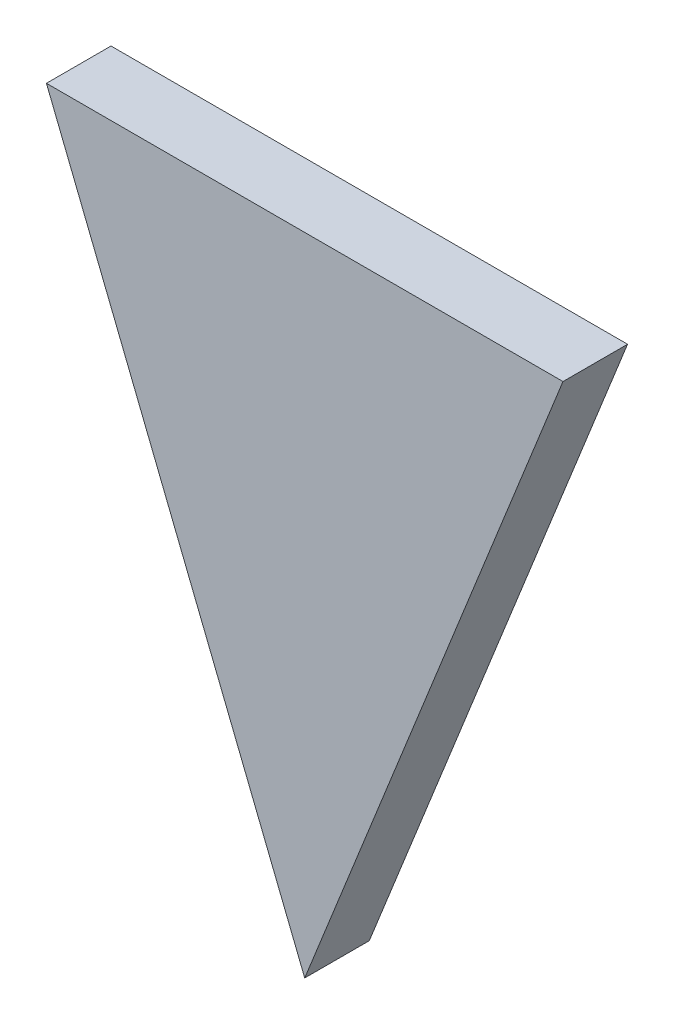
ISO-10303-21;
HEADER;
FILE_DESCRIPTION(('STEP AP214'),'2;1');
FILE_NAME('part.step','',(''),(''),'','','');
FILE_SCHEMA(('AUTOMOTIVE_DESIGN { 1 0 10303 214 1 1 1 1 }'));
ENDSEC;
DATA;
#1=APPLICATION_CONTEXT('core data for automotive mechanical design processes');
#2=APPLICATION_PROTOCOL_DEFINITION('international standard','automotive_design',2000,#1);
#3=PRODUCT_CONTEXT('',#1,'mechanical');
#4=PRODUCT('Part','Part','',(#3));
#5=PRODUCT_RELATED_PRODUCT_CATEGORY('part','',(#4));
#6=PRODUCT_DEFINITION_FORMATION('','',#4);
#7=PRODUCT_DEFINITION_CONTEXT('part definition',#1,'design');
#8=PRODUCT_DEFINITION('design','',#6,#7);
#9=PRODUCT_DEFINITION_SHAPE('','',#8);
#10=(LENGTH_UNIT() NAMED_UNIT(*) SI_UNIT(.MILLI.,.METRE.));
#11=(NAMED_UNIT(*) PLANE_ANGLE_UNIT() SI_UNIT($,.RADIAN.));
#12=(NAMED_UNIT(*) SI_UNIT($,.STERADIAN.) SOLID_ANGLE_UNIT());
#13=UNCERTAINTY_MEASURE_WITH_UNIT(LENGTH_MEASURE(1.E-05),#10,'distance_accuracy_value','');
#14=(GEOMETRIC_REPRESENTATION_CONTEXT(3) GLOBAL_UNCERTAINTY_ASSIGNED_CONTEXT((#13)) GLOBAL_UNIT_ASSIGNED_CONTEXT((#10,
#11,#12)) REPRESENTATION_CONTEXT('',''));
#15=CARTESIAN_POINT('',(0.,0.,0.));
#16=DIRECTION('',(0.,0.,1.));
#17=DIRECTION('',(1.,0.,0.));
#18=AXIS2_PLACEMENT_3D('',#15,#16,#17);
#19=CARTESIAN_POINT('',(0.,0.,0.));
#20=DIRECTION('',(0.,0.,1.));
#21=DIRECTION('',(1.,0.,0.));
#22=AXIS2_PLACEMENT_3D('',#19,#20,#21);
#23=PLANE('',#22);
#24=DIRECTION('',(-1.,0.,0.));
#25=VECTOR('',#24,1.);
#26=CARTESIAN_POINT('',(0.508,1.27,0.));
#27=LINE('',#26,#25);
#28=CARTESIAN_POINT('',(0.508,1.27,0.));
#29=VERTEX_POINT('',#28);
#30=CARTESIAN_POINT('',(-0.508,1.27,0.));
#31=VERTEX_POINT('',#30);
#32=EDGE_CURVE('E10',#29,#31,#27,.T.);
#33=ORIENTED_EDGE('',*,*,#32,.F.);
#34=DIRECTION('',(0.371390676354104,0.928476690885259,0.));
#35=VECTOR('',#34,1.);
#36=CARTESIAN_POINT('',(0.,0.,0.));
#37=LINE('',#36,#35);
#38=CARTESIAN_POINT('',(0.,0.,0.));
#39=VERTEX_POINT('',#38);
#40=EDGE_CURVE('E24',#39,#29,#37,.T.);
#41=ORIENTED_EDGE('',*,*,#40,.F.);
#42=DIRECTION('',(0.371390676354104,-0.928476690885259,0.));
#43=VECTOR('',#42,1.);
#44=CARTESIAN_POINT('',(-0.508,1.27,0.));
#45=LINE('',#44,#43);
#46=EDGE_CURVE('E81',#31,#39,#45,.T.);
#47=ORIENTED_EDGE('',*,*,#46,.F.);
#48=EDGE_LOOP('',(#33,#41,#47));
#49=FACE_BOUND('',#48,.T.);
#50=ADVANCED_FACE('F16',(#49),#23,.F.);
#51=CARTESIAN_POINT('',(-0.508,1.27,0.127));
#52=DIRECTION('',(0.928476690885259,0.371390676354104,0.));
#53=DIRECTION('',(-0.371390676354104,0.928476690885259,0.));
#54=AXIS2_PLACEMENT_3D('',#51,#52,#53);
#55=PLANE('',#54);
#56=ORIENTED_EDGE('',*,*,#46,.T.);
#57=DIRECTION('',(0.,0.,-1.));
#58=VECTOR('',#57,1.);
#59=CARTESIAN_POINT('',(0.,0.,0.127));
#60=LINE('',#59,#58);
#61=CARTESIAN_POINT('',(0.,0.,0.127));
#62=VERTEX_POINT('',#61);
#63=EDGE_CURVE('E77',#62,#39,#60,.T.);
#64=ORIENTED_EDGE('',*,*,#63,.F.);
#65=DIRECTION('',(0.371390676354104,-0.928476690885259,0.));
#66=VECTOR('',#65,1.);
#67=CARTESIAN_POINT('',(-0.508,1.27,0.127));
#68=LINE('',#67,#66);
#69=CARTESIAN_POINT('',(-0.508,1.27,0.127));
#70=VERTEX_POINT('',#69);
#71=EDGE_CURVE('E64',#70,#62,#68,.T.);
#72=ORIENTED_EDGE('',*,*,#71,.F.);
#73=DIRECTION('',(0.,0.,-1.));
#74=VECTOR('',#73,1.);
#75=CARTESIAN_POINT('',(-0.508,1.27,0.127));
#76=LINE('',#75,#74);
#77=EDGE_CURVE('E52',#70,#31,#76,.T.);
#78=ORIENTED_EDGE('',*,*,#77,.T.);
#79=EDGE_LOOP('',(#56,#64,#72,#78));
#80=FACE_BOUND('',#79,.T.);
#81=ADVANCED_FACE('F90',(#80),#55,.F.);
#82=CARTESIAN_POINT('',(0.508,1.27,0.127));
#83=DIRECTION('',(0.,-1.,0.));
#84=DIRECTION('',(0.,0.,-1.));
#85=AXIS2_PLACEMENT_3D('',#82,#83,#84);
#86=PLANE('',#85);
#87=ORIENTED_EDGE('',*,*,#32,.T.);
#88=ORIENTED_EDGE('',*,*,#77,.F.);
#89=DIRECTION('',(-1.,0.,0.));
#90=VECTOR('',#89,1.);
#91=CARTESIAN_POINT('',(0.508,1.27,0.127));
#92=LINE('',#91,#90);
#93=CARTESIAN_POINT('',(0.508,1.27,0.127));
#94=VERTEX_POINT('',#93);
#95=EDGE_CURVE('E47',#94,#70,#92,.T.);
#96=ORIENTED_EDGE('',*,*,#95,.F.);
#97=DIRECTION('',(0.,0.,-1.));
#98=VECTOR('',#97,1.);
#99=CARTESIAN_POINT('',(0.508,1.27,0.127));
#100=LINE('',#99,#98);
#101=EDGE_CURVE('E50',#94,#29,#100,.T.);
#102=ORIENTED_EDGE('',*,*,#101,.T.);
#103=EDGE_LOOP('',(#87,#88,#96,#102));
#104=FACE_BOUND('',#103,.T.);
#105=ADVANCED_FACE('F49',(#104),#86,.F.);
#106=CARTESIAN_POINT('',(0.,0.,0.127));
#107=DIRECTION('',(-0.928476690885259,0.371390676354104,0.));
#108=DIRECTION('',(-0.371390676354104,-0.928476690885259,0.));
#109=AXIS2_PLACEMENT_3D('',#106,#107,#108);
#110=PLANE('',#109);
#111=ORIENTED_EDGE('',*,*,#40,.T.);
#112=ORIENTED_EDGE('',*,*,#101,.F.);
#113=DIRECTION('',(0.371390676354104,0.928476690885259,0.));
#114=VECTOR('',#113,1.);
#115=CARTESIAN_POINT('',(0.,0.,0.127));
#116=LINE('',#115,#114);
#117=EDGE_CURVE('E61',#62,#94,#116,.T.);
#118=ORIENTED_EDGE('',*,*,#117,.F.);
#119=ORIENTED_EDGE('',*,*,#63,.T.);
#120=EDGE_LOOP('',(#111,#112,#118,#119));
#121=FACE_BOUND('',#120,.T.);
#122=ADVANCED_FACE('F59',(#121),#110,.F.);
#123=CARTESIAN_POINT('',(0.,0.,0.127));
#124=DIRECTION('',(0.,0.,1.));
#125=DIRECTION('',(1.,0.,0.));
#126=AXIS2_PLACEMENT_3D('',#123,#124,#125);
#127=PLANE('',#126);
#128=ORIENTED_EDGE('',*,*,#95,.T.);
#129=ORIENTED_EDGE('',*,*,#71,.T.);
#130=ORIENTED_EDGE('',*,*,#117,.T.);
#131=EDGE_LOOP('',(#128,#129,#130));
#132=FACE_BOUND('',#131,.T.);
#133=ADVANCED_FACE('F63',(#132),#127,.T.);
#134=CLOSED_SHELL('',(#50,#81,#105,#122,#133));
#135=MANIFOLD_SOLID_BREP('B1',#134);
#136=ADVANCED_BREP_SHAPE_REPRESENTATION('',(#18,#135),#14);
#137=SHAPE_DEFINITION_REPRESENTATION(#9,#136);
ENDSEC;
END-ISO-10303-21;
